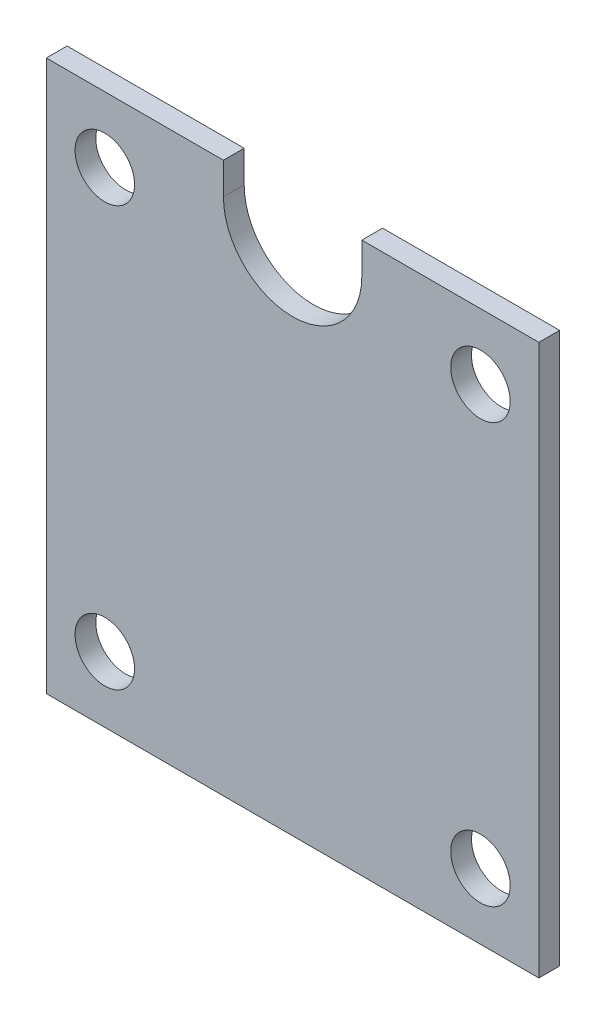
ISO-10303-21;
HEADER;
FILE_DESCRIPTION(('STEP AP214'),'2;1');
FILE_NAME('part.step','',(''),(''),'','','');
FILE_SCHEMA(('AUTOMOTIVE_DESIGN { 1 0 10303 214 1 1 1 1 }'));
ENDSEC;
DATA;
#1=APPLICATION_CONTEXT('core data for automotive mechanical design processes');
#2=APPLICATION_PROTOCOL_DEFINITION('international standard','automotive_design',2000,#1);
#3=PRODUCT_CONTEXT('',#1,'mechanical');
#4=PRODUCT('Part','Part','',(#3));
#5=PRODUCT_RELATED_PRODUCT_CATEGORY('part','',(#4));
#6=PRODUCT_DEFINITION_FORMATION('','',#4);
#7=PRODUCT_DEFINITION_CONTEXT('part definition',#1,'design');
#8=PRODUCT_DEFINITION('design','',#6,#7);
#9=PRODUCT_DEFINITION_SHAPE('','',#8);
#10=(LENGTH_UNIT() NAMED_UNIT(*) SI_UNIT(.MILLI.,.METRE.));
#11=(NAMED_UNIT(*) PLANE_ANGLE_UNIT() SI_UNIT($,.RADIAN.));
#12=(NAMED_UNIT(*) SI_UNIT($,.STERADIAN.) SOLID_ANGLE_UNIT());
#13=UNCERTAINTY_MEASURE_WITH_UNIT(LENGTH_MEASURE(1.E-05),#10,'distance_accuracy_value','');
#14=(GEOMETRIC_REPRESENTATION_CONTEXT(3) GLOBAL_UNCERTAINTY_ASSIGNED_CONTEXT((#13)) GLOBAL_UNIT_ASSIGNED_CONTEXT((#10,
#11,#12)) REPRESENTATION_CONTEXT('',''));
#15=CARTESIAN_POINT('',(0.,0.,0.));
#16=DIRECTION('',(0.,0.,1.));
#17=DIRECTION('',(1.,0.,0.));
#18=AXIS2_PLACEMENT_3D('',#15,#16,#17);
#19=CARTESIAN_POINT('',(0.,35.2,3.));
#20=DIRECTION('',(0.,0.,-1.));
#21=DIRECTION('',(-1.,0.,0.));
#22=AXIS2_PLACEMENT_3D('',#19,#20,#21);
#23=CYLINDRICAL_SURFACE('',#22,10.);
#24=CARTESIAN_POINT('',(0.,35.2,0.));
#25=DIRECTION('',(0.,0.,1.));
#26=DIRECTION('',(1.,0.,0.));
#27=AXIS2_PLACEMENT_3D('',#24,#25,#26);
#28=CIRCLE('',#27,10.);
#29=CARTESIAN_POINT('',(-10.,35.2,0.));
#30=VERTEX_POINT('',#29);
#31=CARTESIAN_POINT('',(10.,35.2,0.));
#32=VERTEX_POINT('',#31);
#33=EDGE_CURVE('E170',#30,#32,#28,.T.);
#34=ORIENTED_EDGE('',*,*,#33,.F.);
#35=DIRECTION('',(0.,0.,-1.));
#36=VECTOR('',#35,1.);
#37=CARTESIAN_POINT('',(-10.,35.2,3.));
#38=LINE('',#37,#36);
#39=CARTESIAN_POINT('',(-10.,35.2,3.));
#40=VERTEX_POINT('',#39);
#41=EDGE_CURVE('E11',#40,#30,#38,.T.);
#42=ORIENTED_EDGE('',*,*,#41,.F.);
#43=CARTESIAN_POINT('',(0.,35.2,3.));
#44=DIRECTION('',(0.,0.,1.));
#45=DIRECTION('',(1.,0.,0.));
#46=AXIS2_PLACEMENT_3D('',#43,#44,#45);
#47=CIRCLE('',#46,10.);
#48=CARTESIAN_POINT('',(10.,35.2,3.));
#49=VERTEX_POINT('',#48);
#50=EDGE_CURVE('E138',#40,#49,#47,.T.);
#51=ORIENTED_EDGE('',*,*,#50,.T.);
#52=DIRECTION('',(0.,0.,-1.));
#53=VECTOR('',#52,1.);
#54=CARTESIAN_POINT('',(10.,35.2,3.));
#55=LINE('',#54,#53);
#56=EDGE_CURVE('E50',#49,#32,#55,.T.);
#57=ORIENTED_EDGE('',*,*,#56,.T.);
#58=EDGE_LOOP('',(#34,#42,#51,#57));
#59=FACE_BOUND('',#58,.T.);
#60=ADVANCED_FACE('F34',(#59),#23,.F.);
#61=CARTESIAN_POINT('',(-10.,0.,3.));
#62=DIRECTION('',(-1.,0.,0.));
#63=DIRECTION('',(0.,-1.,0.));
#64=AXIS2_PLACEMENT_3D('',#61,#62,#63);
#65=PLANE('',#64);
#66=DIRECTION('',(0.,1.,0.));
#67=VECTOR('',#66,1.);
#68=CARTESIAN_POINT('',(-10.,0.,0.));
#69=LINE('',#68,#67);
#70=CARTESIAN_POINT('',(-10.,39.7849441991025,0.));
#71=VERTEX_POINT('',#70);
#72=EDGE_CURVE('E167',#30,#71,#69,.T.);
#73=ORIENTED_EDGE('',*,*,#72,.T.);
#74=DIRECTION('',(0.,0.,-1.));
#75=VECTOR('',#74,1.);
#76=CARTESIAN_POINT('',(-10.,39.7849441991025,3.));
#77=LINE('',#76,#75);
#78=CARTESIAN_POINT('',(-10.,39.7849441991025,3.));
#79=VERTEX_POINT('',#78);
#80=EDGE_CURVE('E42',#79,#71,#77,.T.);
#81=ORIENTED_EDGE('',*,*,#80,.F.);
#82=DIRECTION('',(0.,1.,0.));
#83=VECTOR('',#82,1.);
#84=CARTESIAN_POINT('',(-10.,0.,3.));
#85=LINE('',#84,#83);
#86=EDGE_CURVE('E134',#40,#79,#85,.T.);
#87=ORIENTED_EDGE('',*,*,#86,.F.);
#88=ORIENTED_EDGE('',*,*,#41,.T.);
#89=EDGE_LOOP('',(#73,#81,#87,#88));
#90=FACE_BOUND('',#89,.T.);
#91=ADVANCED_FACE('F168',(#90),#65,.F.);
#92=CARTESIAN_POINT('',(0.,39.7849441991025,3.));
#93=DIRECTION('',(0.,1.,0.));
#94=DIRECTION('',(0.,0.,1.));
#95=AXIS2_PLACEMENT_3D('',#92,#93,#94);
#96=PLANE('',#95);
#97=DIRECTION('',(1.,0.,0.));
#98=VECTOR('',#97,1.);
#99=CARTESIAN_POINT('',(0.,39.7849441991025,0.));
#100=LINE('',#99,#98);
#101=CARTESIAN_POINT('',(-35.5927941804843,39.7849441991025,0.));
#102=VERTEX_POINT('',#101);
#103=EDGE_CURVE('E163',#102,#71,#100,.T.);
#104=ORIENTED_EDGE('',*,*,#103,.F.);
#105=DIRECTION('',(0.,0.,-1.));
#106=VECTOR('',#105,1.);
#107=CARTESIAN_POINT('',(-35.5927941804843,39.7849441991025,3.));
#108=LINE('',#107,#106);
#109=CARTESIAN_POINT('',(-35.5927941804843,39.7849441991025,3.));
#110=VERTEX_POINT('',#109);
#111=EDGE_CURVE('E158',#110,#102,#108,.T.);
#112=ORIENTED_EDGE('',*,*,#111,.F.);
#113=DIRECTION('',(1.,0.,0.));
#114=VECTOR('',#113,1.);
#115=CARTESIAN_POINT('',(0.,39.7849441991025,3.));
#116=LINE('',#115,#114);
#117=EDGE_CURVE('E127',#110,#79,#116,.T.);
#118=ORIENTED_EDGE('',*,*,#117,.T.);
#119=ORIENTED_EDGE('',*,*,#80,.T.);
#120=EDGE_LOOP('',(#104,#112,#118,#119));
#121=FACE_BOUND('',#120,.T.);
#122=ADVANCED_FACE('F161',(#121),#96,.T.);
#123=CARTESIAN_POINT('',(-35.5927941804843,0.,3.));
#124=DIRECTION('',(-1.,0.,0.));
#125=DIRECTION('',(0.,0.,1.));
#126=AXIS2_PLACEMENT_3D('',#123,#124,#125);
#127=PLANE('',#126);
#128=DIRECTION('',(0.,1.,0.));
#129=VECTOR('',#128,1.);
#130=CARTESIAN_POINT('',(-35.5927941804843,0.,0.));
#131=LINE('',#130,#129);
#132=CARTESIAN_POINT('',(-35.5927941804843,-39.7849441991025,0.));
#133=VERTEX_POINT('',#132);
#134=EDGE_CURVE('E176',#133,#102,#131,.T.);
#135=ORIENTED_EDGE('',*,*,#134,.F.);
#136=DIRECTION('',(0.,0.,-1.));
#137=VECTOR('',#136,1.);
#138=CARTESIAN_POINT('',(-35.5927941804843,-39.7849441991025,3.));
#139=LINE('',#138,#137);
#140=CARTESIAN_POINT('',(-35.5927941804843,-39.7849441991025,3.));
#141=VERTEX_POINT('',#140);
#142=EDGE_CURVE('E156',#141,#133,#139,.T.);
#143=ORIENTED_EDGE('',*,*,#142,.F.);
#144=DIRECTION('',(0.,1.,0.));
#145=VECTOR('',#144,1.);
#146=CARTESIAN_POINT('',(-35.5927941804843,0.,3.));
#147=LINE('',#146,#145);
#148=EDGE_CURVE('E133',#141,#110,#147,.T.);
#149=ORIENTED_EDGE('',*,*,#148,.T.);
#150=ORIENTED_EDGE('',*,*,#111,.T.);
#151=EDGE_LOOP('',(#135,#143,#149,#150));
#152=FACE_BOUND('',#151,.T.);
#153=ADVANCED_FACE('F306',(#152),#127,.T.);
#154=CARTESIAN_POINT('',(0.,-39.7849441991025,3.));
#155=DIRECTION('',(0.,1.,0.));
#156=DIRECTION('',(0.,0.,1.));
#157=AXIS2_PLACEMENT_3D('',#154,#155,#156);
#158=PLANE('',#157);
#159=DIRECTION('',(1.,0.,0.));
#160=VECTOR('',#159,1.);
#161=CARTESIAN_POINT('',(0.,-39.7849441991025,0.));
#162=LINE('',#161,#160);
#163=CARTESIAN_POINT('',(35.5927941804843,-39.7849441991025,0.));
#164=VERTEX_POINT('',#163);
#165=EDGE_CURVE('E179',#133,#164,#162,.T.);
#166=ORIENTED_EDGE('',*,*,#165,.T.);
#167=DIRECTION('',(0.,0.,-1.));
#168=VECTOR('',#167,1.);
#169=CARTESIAN_POINT('',(35.5927941804843,-39.7849441991025,3.));
#170=LINE('',#169,#168);
#171=CARTESIAN_POINT('',(35.5927941804843,-39.7849441991025,3.));
#172=VERTEX_POINT('',#171);
#173=EDGE_CURVE('E122',#172,#164,#170,.T.);
#174=ORIENTED_EDGE('',*,*,#173,.F.);
#175=DIRECTION('',(1.,0.,0.));
#176=VECTOR('',#175,1.);
#177=CARTESIAN_POINT('',(0.,-39.7849441991025,3.));
#178=LINE('',#177,#176);
#179=EDGE_CURVE('E110',#141,#172,#178,.T.);
#180=ORIENTED_EDGE('',*,*,#179,.F.);
#181=ORIENTED_EDGE('',*,*,#142,.T.);
#182=EDGE_LOOP('',(#166,#174,#180,#181));
#183=FACE_BOUND('',#182,.T.);
#184=ADVANCED_FACE('F297',(#183),#158,.F.);
#185=CARTESIAN_POINT('',(35.5927941804843,0.,3.));
#186=DIRECTION('',(-1.,0.,0.));
#187=DIRECTION('',(0.,0.,1.));
#188=AXIS2_PLACEMENT_3D('',#185,#186,#187);
#189=PLANE('',#188);
#190=DIRECTION('',(0.,1.,0.));
#191=VECTOR('',#190,1.);
#192=CARTESIAN_POINT('',(35.5927941804843,0.,0.));
#193=LINE('',#192,#191);
#194=CARTESIAN_POINT('',(35.5927941804843,39.7849441991025,0.));
#195=VERTEX_POINT('',#194);
#196=EDGE_CURVE('E119',#164,#195,#193,.T.);
#197=ORIENTED_EDGE('',*,*,#196,.T.);
#198=DIRECTION('',(0.,0.,-1.));
#199=VECTOR('',#198,1.);
#200=CARTESIAN_POINT('',(35.5927941804843,39.7849441991025,3.));
#201=LINE('',#200,#199);
#202=CARTESIAN_POINT('',(35.5927941804843,39.7849441991025,3.));
#203=VERTEX_POINT('',#202);
#204=EDGE_CURVE('E116',#203,#195,#201,.T.);
#205=ORIENTED_EDGE('',*,*,#204,.F.);
#206=DIRECTION('',(0.,1.,0.));
#207=VECTOR('',#206,1.);
#208=CARTESIAN_POINT('',(35.5927941804843,0.,3.));
#209=LINE('',#208,#207);
#210=EDGE_CURVE('E100',#172,#203,#209,.T.);
#211=ORIENTED_EDGE('',*,*,#210,.F.);
#212=ORIENTED_EDGE('',*,*,#173,.T.);
#213=EDGE_LOOP('',(#197,#205,#211,#212));
#214=FACE_BOUND('',#213,.T.);
#215=ADVANCED_FACE('F117',(#214),#189,.F.);
#216=CARTESIAN_POINT('',(10.,39.7849441991025,0.));
#217=VERTEX_POINT('',#216);
#218=EDGE_CURVE('E178',#217,#195,#100,.T.);
#219=ORIENTED_EDGE('',*,*,#218,.F.);
#220=DIRECTION('',(0.,0.,-1.));
#221=VECTOR('',#220,1.);
#222=CARTESIAN_POINT('',(10.,39.7849441991025,3.));
#223=LINE('',#222,#221);
#224=CARTESIAN_POINT('',(10.,39.7849441991025,3.));
#225=VERTEX_POINT('',#224);
#226=EDGE_CURVE('E75',#225,#217,#223,.T.);
#227=ORIENTED_EDGE('',*,*,#226,.F.);
#228=EDGE_CURVE('E107',#225,#203,#116,.T.);
#229=ORIENTED_EDGE('',*,*,#228,.T.);
#230=ORIENTED_EDGE('',*,*,#204,.T.);
#231=EDGE_LOOP('',(#219,#227,#229,#230));
#232=FACE_BOUND('',#231,.T.);
#233=ADVANCED_FACE('F124',(#232),#96,.T.);
#234=CARTESIAN_POINT('',(27.15,-30.3,3.));
#235=DIRECTION('',(0.,0.,-1.));
#236=DIRECTION('',(-1.,0.,0.));
#237=AXIS2_PLACEMENT_3D('',#234,#235,#236);
#238=CYLINDRICAL_SURFACE('',#237,4.29999999999999);
#239=CARTESIAN_POINT('',(27.15,-30.3,3.));
#240=DIRECTION('',(0.,0.,1.));
#241=DIRECTION('',(1.,0.,0.));
#242=AXIS2_PLACEMENT_3D('',#239,#240,#241);
#243=CIRCLE('',#242,4.29999999999999);
#244=CARTESIAN_POINT('',(31.45,-30.3,3.));
#245=VERTEX_POINT('',#244);
#246=EDGE_CURVE('E218',#245,#245,#243,.T.);
#247=ORIENTED_EDGE('',*,*,#246,.T.);
#248=EDGE_LOOP('',(#247));
#249=FACE_BOUND('',#248,.T.);
#250=CARTESIAN_POINT('',(27.15,-30.3,0.));
#251=DIRECTION('',(0.,0.,1.));
#252=DIRECTION('',(1.,0.,0.));
#253=AXIS2_PLACEMENT_3D('',#250,#251,#252);
#254=CIRCLE('',#253,4.29999999999999);
#255=CARTESIAN_POINT('',(31.45,-30.3,0.));
#256=VERTEX_POINT('',#255);
#257=EDGE_CURVE('E143',#256,#256,#254,.T.);
#258=ORIENTED_EDGE('',*,*,#257,.F.);
#259=EDGE_LOOP('',(#258));
#260=FACE_BOUND('',#259,.T.);
#261=ADVANCED_FACE('F197',(#249,#260),#238,.F.);
#262=CARTESIAN_POINT('',(-27.15,-30.3,3.));
#263=DIRECTION('',(0.,0.,-1.));
#264=DIRECTION('',(-1.,0.,0.));
#265=AXIS2_PLACEMENT_3D('',#262,#263,#264);
#266=CYLINDRICAL_SURFACE('',#265,4.3);
#267=CARTESIAN_POINT('',(-27.15,-30.3,3.));
#268=DIRECTION('',(0.,0.,1.));
#269=DIRECTION('',(1.,0.,0.));
#270=AXIS2_PLACEMENT_3D('',#267,#268,#269);
#271=CIRCLE('',#270,4.3);
#272=CARTESIAN_POINT('',(-22.85,-30.3,3.));
#273=VERTEX_POINT('',#272);
#274=EDGE_CURVE('E221',#273,#273,#271,.T.);
#275=ORIENTED_EDGE('',*,*,#274,.T.);
#276=EDGE_LOOP('',(#275));
#277=FACE_BOUND('',#276,.T.);
#278=CARTESIAN_POINT('',(-27.15,-30.3,0.));
#279=DIRECTION('',(0.,0.,1.));
#280=DIRECTION('',(1.,0.,0.));
#281=AXIS2_PLACEMENT_3D('',#278,#279,#280);
#282=CIRCLE('',#281,4.3);
#283=CARTESIAN_POINT('',(-22.85,-30.3,0.));
#284=VERTEX_POINT('',#283);
#285=EDGE_CURVE('E148',#284,#284,#282,.T.);
#286=ORIENTED_EDGE('',*,*,#285,.F.);
#287=EDGE_LOOP('',(#286));
#288=FACE_BOUND('',#287,.T.);
#289=ADVANCED_FACE('F194',(#277,#288),#266,.F.);
#290=CARTESIAN_POINT('',(-27.15,30.3,3.));
#291=DIRECTION('',(0.,0.,-1.));
#292=DIRECTION('',(-1.,0.,0.));
#293=AXIS2_PLACEMENT_3D('',#290,#291,#292);
#294=CYLINDRICAL_SURFACE('',#293,4.3);
#295=CARTESIAN_POINT('',(-27.15,30.3,3.));
#296=DIRECTION('',(0.,0.,1.));
#297=DIRECTION('',(1.,0.,0.));
#298=AXIS2_PLACEMENT_3D('',#295,#296,#297);
#299=CIRCLE('',#298,4.3);
#300=CARTESIAN_POINT('',(-22.85,30.3,3.));
#301=VERTEX_POINT('',#300);
#302=EDGE_CURVE('E128',#301,#301,#299,.T.);
#303=ORIENTED_EDGE('',*,*,#302,.T.);
#304=EDGE_LOOP('',(#303));
#305=FACE_BOUND('',#304,.T.);
#306=CARTESIAN_POINT('',(-27.15,30.3,0.));
#307=DIRECTION('',(0.,0.,1.));
#308=DIRECTION('',(1.,0.,0.));
#309=AXIS2_PLACEMENT_3D('',#306,#307,#308);
#310=CIRCLE('',#309,4.3);
#311=CARTESIAN_POINT('',(-22.85,30.3,0.));
#312=VERTEX_POINT('',#311);
#313=EDGE_CURVE('E183',#312,#312,#310,.T.);
#314=ORIENTED_EDGE('',*,*,#313,.F.);
#315=EDGE_LOOP('',(#314));
#316=FACE_BOUND('',#315,.T.);
#317=ADVANCED_FACE('F196',(#305,#316),#294,.F.);
#318=CARTESIAN_POINT('',(10.,0.,3.));
#319=DIRECTION('',(-1.,0.,0.));
#320=DIRECTION('',(0.,-1.,0.));
#321=AXIS2_PLACEMENT_3D('',#318,#319,#320);
#322=PLANE('',#321);
#323=DIRECTION('',(0.,1.,0.));
#324=VECTOR('',#323,1.);
#325=CARTESIAN_POINT('',(10.,0.,0.));
#326=LINE('',#325,#324);
#327=EDGE_CURVE('E181',#32,#217,#326,.T.);
#328=ORIENTED_EDGE('',*,*,#327,.F.);
#329=ORIENTED_EDGE('',*,*,#56,.F.);
#330=DIRECTION('',(0.,1.,0.));
#331=VECTOR('',#330,1.);
#332=CARTESIAN_POINT('',(10.,0.,3.));
#333=LINE('',#332,#331);
#334=EDGE_CURVE('E125',#49,#225,#333,.T.);
#335=ORIENTED_EDGE('',*,*,#334,.T.);
#336=ORIENTED_EDGE('',*,*,#226,.T.);
#337=EDGE_LOOP('',(#328,#329,#335,#336));
#338=FACE_BOUND('',#337,.T.);
#339=ADVANCED_FACE('F204',(#338),#322,.T.);
#340=CARTESIAN_POINT('',(27.15,30.3,3.));
#341=DIRECTION('',(0.,0.,-1.));
#342=DIRECTION('',(-1.,0.,0.));
#343=AXIS2_PLACEMENT_3D('',#340,#341,#342);
#344=CYLINDRICAL_SURFACE('',#343,4.29999999999999);
#345=CARTESIAN_POINT('',(27.15,30.3,3.));
#346=DIRECTION('',(0.,0.,1.));
#347=DIRECTION('',(1.,0.,0.));
#348=AXIS2_PLACEMENT_3D('',#345,#346,#347);
#349=CIRCLE('',#348,4.29999999999999);
#350=CARTESIAN_POINT('',(31.45,30.3,3.));
#351=VERTEX_POINT('',#350);
#352=EDGE_CURVE('E153',#351,#351,#349,.T.);
#353=ORIENTED_EDGE('',*,*,#352,.T.);
#354=EDGE_LOOP('',(#353));
#355=FACE_BOUND('',#354,.T.);
#356=CARTESIAN_POINT('',(27.15,30.3,0.));
#357=DIRECTION('',(0.,0.,1.));
#358=DIRECTION('',(1.,0.,0.));
#359=AXIS2_PLACEMENT_3D('',#356,#357,#358);
#360=CIRCLE('',#359,4.29999999999999);
#361=CARTESIAN_POINT('',(31.45,30.3,0.));
#362=VERTEX_POINT('',#361);
#363=EDGE_CURVE('E140',#362,#362,#360,.T.);
#364=ORIENTED_EDGE('',*,*,#363,.F.);
#365=EDGE_LOOP('',(#364));
#366=FACE_BOUND('',#365,.T.);
#367=ADVANCED_FACE('F229',(#355,#366),#344,.F.);
#368=CARTESIAN_POINT('',(0.,0.,3.));
#369=DIRECTION('',(0.,0.,1.));
#370=DIRECTION('',(1.,0.,0.));
#371=AXIS2_PLACEMENT_3D('',#368,#369,#370);
#372=PLANE('',#371);
#373=ORIENTED_EDGE('',*,*,#50,.F.);
#374=ORIENTED_EDGE('',*,*,#86,.T.);
#375=ORIENTED_EDGE('',*,*,#117,.F.);
#376=ORIENTED_EDGE('',*,*,#148,.F.);
#377=ORIENTED_EDGE('',*,*,#179,.T.);
#378=ORIENTED_EDGE('',*,*,#210,.T.);
#379=ORIENTED_EDGE('',*,*,#228,.F.);
#380=ORIENTED_EDGE('',*,*,#334,.F.);
#381=EDGE_LOOP('',(#373,#374,#375,#376,#377,#378,#379,#380));
#382=FACE_BOUND('',#381,.T.);
#383=ORIENTED_EDGE('',*,*,#302,.F.);
#384=EDGE_LOOP('',(#383));
#385=FACE_BOUND('',#384,.T.);
#386=ORIENTED_EDGE('',*,*,#274,.F.);
#387=EDGE_LOOP('',(#386));
#388=FACE_BOUND('',#387,.T.);
#389=ORIENTED_EDGE('',*,*,#246,.F.);
#390=EDGE_LOOP('',(#389));
#391=FACE_BOUND('',#390,.T.);
#392=ORIENTED_EDGE('',*,*,#352,.F.);
#393=EDGE_LOOP('',(#392));
#394=FACE_BOUND('',#393,.T.);
#395=ADVANCED_FACE('F103',(#382,#385,#388,#391,#394),#372,.T.);
#396=CARTESIAN_POINT('',(0.,0.,0.));
#397=DIRECTION('',(0.,0.,1.));
#398=DIRECTION('',(1.,0.,0.));
#399=AXIS2_PLACEMENT_3D('',#396,#397,#398);
#400=PLANE('',#399);
#401=ORIENTED_EDGE('',*,*,#33,.T.);
#402=ORIENTED_EDGE('',*,*,#327,.T.);
#403=ORIENTED_EDGE('',*,*,#218,.T.);
#404=ORIENTED_EDGE('',*,*,#196,.F.);
#405=ORIENTED_EDGE('',*,*,#165,.F.);
#406=ORIENTED_EDGE('',*,*,#134,.T.);
#407=ORIENTED_EDGE('',*,*,#103,.T.);
#408=ORIENTED_EDGE('',*,*,#72,.F.);
#409=EDGE_LOOP('',(#401,#402,#403,#404,#405,#406,#407,#408));
#410=FACE_BOUND('',#409,.T.);
#411=ORIENTED_EDGE('',*,*,#313,.T.);
#412=EDGE_LOOP('',(#411));
#413=FACE_BOUND('',#412,.T.);
#414=ORIENTED_EDGE('',*,*,#285,.T.);
#415=EDGE_LOOP('',(#414));
#416=FACE_BOUND('',#415,.T.);
#417=ORIENTED_EDGE('',*,*,#257,.T.);
#418=EDGE_LOOP('',(#417));
#419=FACE_BOUND('',#418,.T.);
#420=ORIENTED_EDGE('',*,*,#363,.T.);
#421=EDGE_LOOP('',(#420));
#422=FACE_BOUND('',#421,.T.);
#423=ADVANCED_FACE('F172',(#410,#413,#416,#419,#422),#400,.F.);
#424=CLOSED_SHELL('',(#60,#91,#122,#153,#184,#215,#233,#261,#289,#317,#339,#367,#395,#423));
#425=MANIFOLD_SOLID_BREP('B2',#424);
#426=ADVANCED_BREP_SHAPE_REPRESENTATION('',(#18,#425),#14);
#427=SHAPE_DEFINITION_REPRESENTATION(#9,#426);
ENDSEC;
END-ISO-10303-21;
